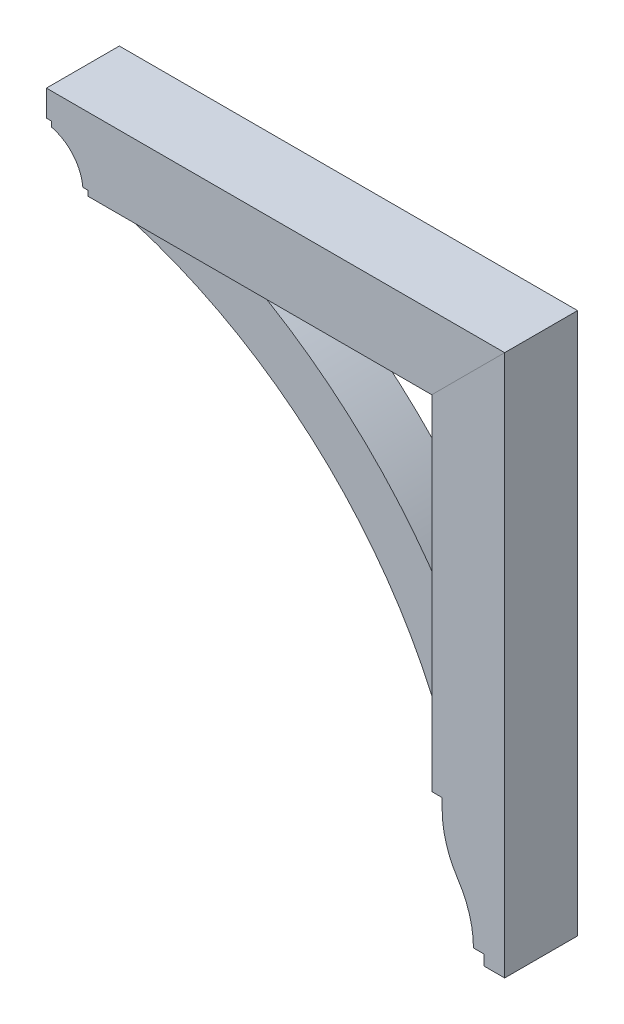
ISO-10303-21;
HEADER;
FILE_DESCRIPTION(('STEP AP214'),'2;1');
FILE_NAME('part.step','',(''),(''),'','','');
FILE_SCHEMA(('AUTOMOTIVE_DESIGN { 1 0 10303 214 1 1 1 1 }'));
ENDSEC;
DATA;
#1=APPLICATION_CONTEXT('core data for automotive mechanical design processes');
#2=APPLICATION_PROTOCOL_DEFINITION('international standard','automotive_design',2000,#1);
#3=PRODUCT_CONTEXT('',#1,'mechanical');
#4=PRODUCT('Part','Part','',(#3));
#5=PRODUCT_RELATED_PRODUCT_CATEGORY('part','',(#4));
#6=PRODUCT_DEFINITION_FORMATION('','',#4);
#7=PRODUCT_DEFINITION_CONTEXT('part definition',#1,'design');
#8=PRODUCT_DEFINITION('design','',#6,#7);
#9=PRODUCT_DEFINITION_SHAPE('','',#8);
#10=(LENGTH_UNIT() NAMED_UNIT(*) SI_UNIT(.MILLI.,.METRE.));
#11=(NAMED_UNIT(*) PLANE_ANGLE_UNIT() SI_UNIT($,.RADIAN.));
#12=(NAMED_UNIT(*) SI_UNIT($,.STERADIAN.) SOLID_ANGLE_UNIT());
#13=UNCERTAINTY_MEASURE_WITH_UNIT(LENGTH_MEASURE(1.E-05),#10,'distance_accuracy_value','');
#14=(GEOMETRIC_REPRESENTATION_CONTEXT(3) GLOBAL_UNCERTAINTY_ASSIGNED_CONTEXT((#13)) GLOBAL_UNIT_ASSIGNED_CONTEXT((#10,
#11,#12)) REPRESENTATION_CONTEXT('',''));
#15=CARTESIAN_POINT('',(0.,0.,0.));
#16=DIRECTION('',(0.,0.,1.));
#17=DIRECTION('',(1.,0.,0.));
#18=AXIS2_PLACEMENT_3D('',#15,#16,#17);
#19=CARTESIAN_POINT('',(246.881223015558,-2.15821431605898E-12,44.45));
#20=DIRECTION('',(1.,0.,0.));
#21=DIRECTION('',(0.,1.,0.));
#22=AXIS2_PLACEMENT_3D('',#19,#20,#21);
#23=PLANE('',#22);
#24=DIRECTION('',(0.,-1.,0.));
#25=VECTOR('',#24,1.);
#26=CARTESIAN_POINT('',(246.881223015558,-2.15821431605898E-12,-44.45));
#27=LINE('',#26,#25);
#28=CARTESIAN_POINT('',(246.881223015556,-183.515,-44.45));
#29=VERTEX_POINT('',#28);
#30=CARTESIAN_POINT('',(246.881223015556,-196.215,-44.45));
#31=VERTEX_POINT('',#30);
#32=EDGE_CURVE('E171',#29,#31,#27,.T.);
#33=ORIENTED_EDGE('',*,*,#32,.T.);
#34=DIRECTION('',(0.,0.,-1.));
#35=VECTOR('',#34,1.);
#36=CARTESIAN_POINT('',(246.881223015556,-196.215,44.45));
#37=LINE('',#36,#35);
#38=CARTESIAN_POINT('',(246.881223015556,-196.215,44.45));
#39=VERTEX_POINT('',#38);
#40=EDGE_CURVE('E12',#39,#31,#37,.T.);
#41=ORIENTED_EDGE('',*,*,#40,.F.);
#42=DIRECTION('',(0.,-1.,0.));
#43=VECTOR('',#42,1.);
#44=CARTESIAN_POINT('',(246.881223015558,-2.15821431605898E-12,44.45));
#45=LINE('',#44,#43);
#46=CARTESIAN_POINT('',(246.881223015556,-183.515,44.45));
#47=VERTEX_POINT('',#46);
#48=EDGE_CURVE('E203',#47,#39,#45,.T.);
#49=ORIENTED_EDGE('',*,*,#48,.F.);
#50=DIRECTION('',(0.,0.,-1.));
#51=VECTOR('',#50,1.);
#52=CARTESIAN_POINT('',(246.881223015556,-183.515,44.45));
#53=LINE('',#52,#51);
#54=EDGE_CURVE('E167',#47,#29,#53,.T.);
#55=ORIENTED_EDGE('',*,*,#54,.T.);
#56=EDGE_LOOP('',(#33,#41,#49,#55));
#57=FACE_BOUND('',#56,.T.);
#58=ADVANCED_FACE('F55',(#57),#23,.F.);
#59=CARTESIAN_POINT('',(362.768723015556,-196.215,44.45));
#60=DIRECTION('',(0.,0.,-1.));
#61=DIRECTION('',(-1.,0.,0.));
#62=AXIS2_PLACEMENT_3D('',#59,#60,#61);
#63=CYLINDRICAL_SURFACE('',#62,115.8875);
#64=CARTESIAN_POINT('',(362.768723015556,-196.215,-44.45));
#65=DIRECTION('',(0.,0.,1.));
#66=DIRECTION('',(1.,0.,0.));
#67=AXIS2_PLACEMENT_3D('',#64,#65,#66);
#68=CIRCLE('',#67,115.8875);
#69=CARTESIAN_POINT('',(266.018608336656,-260.006284403669,-44.45));
#70=VERTEX_POINT('',#69);
#71=EDGE_CURVE('E175',#31,#70,#68,.T.);
#72=ORIENTED_EDGE('',*,*,#71,.T.);
#73=DIRECTION('',(0.,0.,-1.));
#74=VECTOR('',#73,1.);
#75=CARTESIAN_POINT('',(266.018608336656,-260.006284403669,44.45));
#76=LINE('',#75,#74);
#77=CARTESIAN_POINT('',(266.018608336656,-260.006284403669,44.45));
#78=VERTEX_POINT('',#77);
#79=EDGE_CURVE('E64',#78,#70,#76,.T.);
#80=ORIENTED_EDGE('',*,*,#79,.F.);
#81=CARTESIAN_POINT('',(362.768723015556,-196.215,44.45));
#82=DIRECTION('',(0.,0.,1.));
#83=DIRECTION('',(1.,0.,0.));
#84=AXIS2_PLACEMENT_3D('',#81,#82,#83);
#85=CIRCLE('',#84,115.8875);
#86=EDGE_CURVE('E121',#39,#78,#85,.T.);
#87=ORIENTED_EDGE('',*,*,#86,.F.);
#88=ORIENTED_EDGE('',*,*,#40,.T.);
#89=EDGE_LOOP('',(#72,#80,#87,#88));
#90=FACE_BOUND('',#89,.T.);
#91=ADVANCED_FACE('F229',(#90),#63,.T.);
#92=CARTESIAN_POINT('',(170.152056348885,-323.215,44.45));
#93=DIRECTION('',(0.,0.,-1.));
#94=DIRECTION('',(-1.,0.,0.));
#95=AXIS2_PLACEMENT_3D('',#92,#93,#94);
#96=CYLINDRICAL_SURFACE('',#95,114.82916666667);
#97=CARTESIAN_POINT('',(170.152056348885,-323.215,-44.45));
#98=DIRECTION('',(0.,0.,1.));
#99=DIRECTION('',(1.,0.,0.));
#100=AXIS2_PLACEMENT_3D('',#97,#98,#99);
#101=CIRCLE('',#100,114.82916666667);
#102=CARTESIAN_POINT('',(284.981223015555,-323.215,-44.45));
#103=VERTEX_POINT('',#102);
#104=EDGE_CURVE('E178',#103,#70,#101,.T.);
#105=ORIENTED_EDGE('',*,*,#104,.F.);
#106=DIRECTION('',(0.,0.,-1.));
#107=VECTOR('',#106,1.);
#108=CARTESIAN_POINT('',(284.981223015555,-323.215,44.45));
#109=LINE('',#108,#107);
#110=CARTESIAN_POINT('',(284.981223015555,-323.215,44.45));
#111=VERTEX_POINT('',#110);
#112=EDGE_CURVE('E218',#111,#103,#109,.T.);
#113=ORIENTED_EDGE('',*,*,#112,.F.);
#114=CARTESIAN_POINT('',(170.152056348885,-323.215,44.45));
#115=DIRECTION('',(0.,0.,1.));
#116=DIRECTION('',(1.,0.,0.));
#117=AXIS2_PLACEMENT_3D('',#114,#115,#116);
#118=CIRCLE('',#117,114.82916666667);
#119=EDGE_CURVE('E228',#111,#78,#118,.T.);
#120=ORIENTED_EDGE('',*,*,#119,.T.);
#121=ORIENTED_EDGE('',*,*,#79,.T.);
#122=EDGE_LOOP('',(#105,#113,#120,#121));
#123=FACE_BOUND('',#122,.T.);
#124=ADVANCED_FACE('F226',(#123),#96,.F.);
#125=CARTESIAN_POINT('',(0.,-323.215,44.45));
#126=DIRECTION('',(0.,-1.,0.));
#127=DIRECTION('',(0.,0.,-1.));
#128=AXIS2_PLACEMENT_3D('',#125,#126,#127);
#129=PLANE('',#128);
#130=DIRECTION('',(-1.,0.,0.));
#131=VECTOR('',#130,1.);
#132=CARTESIAN_POINT('',(0.,-323.215,-44.45));
#133=LINE('',#132,#131);
#134=CARTESIAN_POINT('',(297.681223015555,-323.215,-44.45));
#135=VERTEX_POINT('',#134);
#136=EDGE_CURVE('E182',#135,#103,#133,.T.);
#137=ORIENTED_EDGE('',*,*,#136,.F.);
#138=DIRECTION('',(0.,0.,-1.));
#139=VECTOR('',#138,1.);
#140=CARTESIAN_POINT('',(297.681223015555,-323.215,44.45));
#141=LINE('',#140,#139);
#142=CARTESIAN_POINT('',(297.681223015555,-323.215,44.45));
#143=VERTEX_POINT('',#142);
#144=EDGE_CURVE('E215',#143,#135,#141,.T.);
#145=ORIENTED_EDGE('',*,*,#144,.F.);
#146=DIRECTION('',(-1.,0.,0.));
#147=VECTOR('',#146,1.);
#148=CARTESIAN_POINT('',(0.,-323.215,44.45));
#149=LINE('',#148,#147);
#150=EDGE_CURVE('E240',#143,#111,#149,.T.);
#151=ORIENTED_EDGE('',*,*,#150,.T.);
#152=ORIENTED_EDGE('',*,*,#112,.T.);
#153=EDGE_LOOP('',(#137,#145,#151,#152));
#154=FACE_BOUND('',#153,.T.);
#155=ADVANCED_FACE('F237',(#154),#129,.T.);
#156=CARTESIAN_POINT('',(297.681223015555,0.,44.45));
#157=DIRECTION('',(-1.,0.,0.));
#158=DIRECTION('',(0.,0.,1.));
#159=AXIS2_PLACEMENT_3D('',#156,#157,#158);
#160=PLANE('',#159);
#161=DIRECTION('',(0.,1.,0.));
#162=VECTOR('',#161,1.);
#163=CARTESIAN_POINT('',(297.681223015555,0.,-44.45));
#164=LINE('',#163,#162);
#165=CARTESIAN_POINT('',(297.681223015555,-335.915,-44.45));
#166=VERTEX_POINT('',#165);
#167=EDGE_CURVE('E186',#166,#135,#164,.T.);
#168=ORIENTED_EDGE('',*,*,#167,.F.);
#169=DIRECTION('',(0.,0.,-1.));
#170=VECTOR('',#169,1.);
#171=CARTESIAN_POINT('',(297.681223015555,-335.915,44.45));
#172=LINE('',#171,#170);
#173=CARTESIAN_POINT('',(297.681223015555,-335.915,44.45));
#174=VERTEX_POINT('',#173);
#175=EDGE_CURVE('E212',#174,#166,#172,.T.);
#176=ORIENTED_EDGE('',*,*,#175,.F.);
#177=DIRECTION('',(0.,1.,0.));
#178=VECTOR('',#177,1.);
#179=CARTESIAN_POINT('',(297.681223015555,0.,44.45));
#180=LINE('',#179,#178);
#181=EDGE_CURVE('E246',#174,#143,#180,.T.);
#182=ORIENTED_EDGE('',*,*,#181,.T.);
#183=ORIENTED_EDGE('',*,*,#144,.T.);
#184=EDGE_LOOP('',(#168,#176,#182,#183));
#185=FACE_BOUND('',#184,.T.);
#186=ADVANCED_FACE('F261',(#185),#160,.T.);
#187=CARTESIAN_POINT('',(7.34134975033387E-13,-335.915000000001,44.45));
#188=DIRECTION('',(0.,-1.,0.));
#189=DIRECTION('',(1.,0.,0.));
#190=AXIS2_PLACEMENT_3D('',#187,#188,#189);
#191=PLANE('',#190);
#192=DIRECTION('',(-1.,0.,0.));
#193=VECTOR('',#192,1.);
#194=CARTESIAN_POINT('',(7.34134975033387E-13,-335.915000000001,-44.45));
#195=LINE('',#194,#193);
#196=CARTESIAN_POINT('',(323.081223015555,-335.915,-44.45));
#197=VERTEX_POINT('',#196);
#198=EDGE_CURVE('E190',#197,#166,#195,.T.);
#199=ORIENTED_EDGE('',*,*,#198,.F.);
#200=DIRECTION('',(0.,0.,-1.));
#201=VECTOR('',#200,1.);
#202=CARTESIAN_POINT('',(323.081223015555,-335.915,44.45));
#203=LINE('',#202,#201);
#204=CARTESIAN_POINT('',(323.081223015555,-335.915,44.45));
#205=VERTEX_POINT('',#204);
#206=EDGE_CURVE('E209',#205,#197,#203,.T.);
#207=ORIENTED_EDGE('',*,*,#206,.F.);
#208=DIRECTION('',(-1.,0.,0.));
#209=VECTOR('',#208,1.);
#210=CARTESIAN_POINT('',(7.34134975033387E-13,-335.915000000001,44.45));
#211=LINE('',#210,#209);
#212=EDGE_CURVE('E254',#205,#174,#211,.T.);
#213=ORIENTED_EDGE('',*,*,#212,.T.);
#214=ORIENTED_EDGE('',*,*,#175,.T.);
#215=EDGE_LOOP('',(#199,#207,#213,#214));
#216=FACE_BOUND('',#215,.T.);
#217=ADVANCED_FACE('F259',(#216),#191,.T.);
#218=CARTESIAN_POINT('',(323.081223015555,0.,44.45));
#219=DIRECTION('',(-1.,0.,0.));
#220=DIRECTION('',(0.,0.,1.));
#221=AXIS2_PLACEMENT_3D('',#218,#219,#220);
#222=PLANE('',#221);
#223=DIRECTION('',(0.,1.,0.));
#224=VECTOR('',#223,1.);
#225=CARTESIAN_POINT('',(323.081223015555,0.,-44.45));
#226=LINE('',#225,#224);
#227=CARTESIAN_POINT('',(323.081223015555,324.485,-44.45));
#228=VERTEX_POINT('',#227);
#229=EDGE_CURVE('E194',#197,#228,#226,.T.);
#230=ORIENTED_EDGE('',*,*,#229,.T.);
#231=DIRECTION('',(0.,0.,-1.));
#232=VECTOR('',#231,1.);
#233=CARTESIAN_POINT('',(323.081223015555,324.485,44.45));
#234=LINE('',#233,#232);
#235=CARTESIAN_POINT('',(323.081223015555,324.485,44.45));
#236=VERTEX_POINT('',#235);
#237=EDGE_CURVE('E158',#236,#228,#234,.T.);
#238=ORIENTED_EDGE('',*,*,#237,.F.);
#239=DIRECTION('',(0.,1.,0.));
#240=VECTOR('',#239,1.);
#241=CARTESIAN_POINT('',(323.081223015555,0.,44.45));
#242=LINE('',#241,#240);
#243=EDGE_CURVE('E147',#205,#236,#242,.T.);
#244=ORIENTED_EDGE('',*,*,#243,.F.);
#245=ORIENTED_EDGE('',*,*,#206,.T.);
#246=EDGE_LOOP('',(#230,#238,#244,#245));
#247=FACE_BOUND('',#246,.T.);
#248=ADVANCED_FACE('F264',(#247),#222,.F.);
#249=CARTESIAN_POINT('',(-0.701888492220435,0.701888492220426,44.45));
#250=DIRECTION('',(0.707106781186552,-0.707106781186543,0.));
#251=DIRECTION('',(0.707106781186543,0.707106781186552,0.));
#252=AXIS2_PLACEMENT_3D('',#249,#250,#251);
#253=PLANE('',#252);
#254=DIRECTION('',(-0.707106781186543,-0.707106781186552,0.));
#255=VECTOR('',#254,1.);
#256=CARTESIAN_POINT('',(-0.701888492220435,0.701888492220426,-44.45));
#257=LINE('',#256,#255);
#258=CARTESIAN_POINT('',(234.181223015556,235.585,-44.45));
#259=VERTEX_POINT('',#258);
#260=EDGE_CURVE('E156',#228,#259,#257,.T.);
#261=ORIENTED_EDGE('',*,*,#260,.T.);
#262=DIRECTION('',(0.,0.,-1.));
#263=VECTOR('',#262,1.);
#264=CARTESIAN_POINT('',(234.181223015556,235.585,44.45));
#265=LINE('',#264,#263);
#266=CARTESIAN_POINT('',(234.181223015556,235.585,44.45));
#267=VERTEX_POINT('',#266);
#268=EDGE_CURVE('E153',#267,#259,#265,.T.);
#269=ORIENTED_EDGE('',*,*,#268,.F.);
#270=DIRECTION('',(-0.707106781186543,-0.707106781186552,0.));
#271=VECTOR('',#270,1.);
#272=CARTESIAN_POINT('',(-0.701888492220435,0.701888492220426,44.45));
#273=LINE('',#272,#271);
#274=EDGE_CURVE('E140',#236,#267,#273,.T.);
#275=ORIENTED_EDGE('',*,*,#274,.F.);
#276=ORIENTED_EDGE('',*,*,#237,.T.);
#277=EDGE_LOOP('',(#261,#269,#275,#276));
#278=FACE_BOUND('',#277,.T.);
#279=ADVANCED_FACE('F154',(#278),#253,.F.);
#280=CARTESIAN_POINT('',(234.181223015556,0.,44.45));
#281=DIRECTION('',(1.,0.,0.));
#282=DIRECTION('',(0.,1.,0.));
#283=AXIS2_PLACEMENT_3D('',#280,#281,#282);
#284=PLANE('',#283);
#285=DIRECTION('',(0.,-1.,0.));
#286=VECTOR('',#285,1.);
#287=CARTESIAN_POINT('',(234.181223015556,0.,-44.45));
#288=LINE('',#287,#286);
#289=CARTESIAN_POINT('',(234.181223015556,-183.515,-44.45));
#290=VERTEX_POINT('',#289);
#291=EDGE_CURVE('E107',#259,#290,#288,.T.);
#292=ORIENTED_EDGE('',*,*,#291,.T.);
#293=DIRECTION('',(0.,0.,-1.));
#294=VECTOR('',#293,1.);
#295=CARTESIAN_POINT('',(234.181223015556,-183.515,44.45));
#296=LINE('',#295,#294);
#297=CARTESIAN_POINT('',(234.181223015556,-183.515,44.45));
#298=VERTEX_POINT('',#297);
#299=EDGE_CURVE('E159',#298,#290,#296,.T.);
#300=ORIENTED_EDGE('',*,*,#299,.F.);
#301=DIRECTION('',(0.,-1.,0.));
#302=VECTOR('',#301,1.);
#303=CARTESIAN_POINT('',(234.181223015556,0.,44.45));
#304=LINE('',#303,#302);
#305=EDGE_CURVE('E144',#267,#298,#304,.T.);
#306=ORIENTED_EDGE('',*,*,#305,.F.);
#307=ORIENTED_EDGE('',*,*,#268,.T.);
#308=EDGE_LOOP('',(#292,#300,#306,#307));
#309=FACE_BOUND('',#308,.T.);
#310=ADVANCED_FACE('F161',(#309),#284,.F.);
#311=CARTESIAN_POINT('',(0.,-183.515,44.45));
#312=DIRECTION('',(0.,1.,0.));
#313=DIRECTION('',(0.,0.,1.));
#314=AXIS2_PLACEMENT_3D('',#311,#312,#313);
#315=PLANE('',#314);
#316=DIRECTION('',(1.,0.,0.));
#317=VECTOR('',#316,1.);
#318=CARTESIAN_POINT('',(0.,-183.515,-44.45));
#319=LINE('',#318,#317);
#320=EDGE_CURVE('E113',#290,#29,#319,.T.);
#321=ORIENTED_EDGE('',*,*,#320,.T.);
#322=ORIENTED_EDGE('',*,*,#54,.F.);
#323=DIRECTION('',(1.,0.,0.));
#324=VECTOR('',#323,1.);
#325=CARTESIAN_POINT('',(0.,-183.515,44.45));
#326=LINE('',#325,#324);
#327=EDGE_CURVE('E72',#298,#47,#326,.T.);
#328=ORIENTED_EDGE('',*,*,#327,.F.);
#329=ORIENTED_EDGE('',*,*,#299,.T.);
#330=EDGE_LOOP('',(#321,#322,#328,#329));
#331=FACE_BOUND('',#330,.T.);
#332=ADVANCED_FACE('F279',(#331),#315,.F.);
#333=CARTESIAN_POINT('',(0.,0.,44.45));
#334=DIRECTION('',(0.,0.,1.));
#335=DIRECTION('',(1.,0.,0.));
#336=AXIS2_PLACEMENT_3D('',#333,#334,#335);
#337=PLANE('',#336);
#338=ORIENTED_EDGE('',*,*,#48,.T.);
#339=ORIENTED_EDGE('',*,*,#86,.T.);
#340=ORIENTED_EDGE('',*,*,#119,.F.);
#341=ORIENTED_EDGE('',*,*,#150,.F.);
#342=ORIENTED_EDGE('',*,*,#181,.F.);
#343=ORIENTED_EDGE('',*,*,#212,.F.);
#344=ORIENTED_EDGE('',*,*,#243,.T.);
#345=ORIENTED_EDGE('',*,*,#274,.T.);
#346=ORIENTED_EDGE('',*,*,#305,.T.);
#347=ORIENTED_EDGE('',*,*,#327,.T.);
#348=EDGE_LOOP('',(#338,#339,#340,#341,#342,#343,#344,#345,#346,#347));
#349=FACE_BOUND('',#348,.T.);
#350=ADVANCED_FACE('F142',(#349),#337,.T.);
#351=CARTESIAN_POINT('',(0.,0.,-44.45));
#352=DIRECTION('',(0.,0.,1.));
#353=DIRECTION('',(1.,0.,0.));
#354=AXIS2_PLACEMENT_3D('',#351,#352,#353);
#355=PLANE('',#354);
#356=ORIENTED_EDGE('',*,*,#32,.F.);
#357=ORIENTED_EDGE('',*,*,#320,.F.);
#358=ORIENTED_EDGE('',*,*,#291,.F.);
#359=ORIENTED_EDGE('',*,*,#260,.F.);
#360=ORIENTED_EDGE('',*,*,#229,.F.);
#361=ORIENTED_EDGE('',*,*,#198,.T.);
#362=ORIENTED_EDGE('',*,*,#167,.T.);
#363=ORIENTED_EDGE('',*,*,#136,.T.);
#364=ORIENTED_EDGE('',*,*,#104,.T.);
#365=ORIENTED_EDGE('',*,*,#71,.F.);
#366=EDGE_LOOP('',(#356,#357,#358,#359,#360,#361,#362,#363,#364,#365));
#367=FACE_BOUND('',#366,.T.);
#368=ADVANCED_FACE('F233',(#367),#355,.F.);
#369=CLOSED_SHELL('',(#58,#91,#124,#155,#186,#217,#248,#279,#310,#332,#350,#368));
#370=MANIFOLD_SOLID_BREP('B2',#369);
#371=CARTESIAN_POINT('',(-306.558557439418,-332.634542246651,31.75));
#372=DIRECTION('',(0.,0.,-1.));
#373=DIRECTION('',(-1.,0.,0.));
#374=AXIS2_PLACEMENT_3D('',#371,#372,#373);
#375=CYLINDRICAL_SURFACE('',#374,644.525);
#376=CARTESIAN_POINT('',(-306.558557439418,-332.634542246651,-31.75));
#377=DIRECTION('',(0.,0.,1.));
#378=DIRECTION('',(1.,0.,0.));
#379=AXIS2_PLACEMENT_3D('',#376,#377,#378);
#380=CIRCLE('',#379,644.525);
#381=CARTESIAN_POINT('',(-2.35627698444407,235.585,-31.75));
#382=VERTEX_POINT('',#381);
#383=CARTESIAN_POINT('',(234.181223015556,18.0974999999995,-31.75));
#384=VERTEX_POINT('',#383);
#385=EDGE_CURVE('E474',#382,#384,#380,.F.);
#386=ORIENTED_EDGE('',*,*,#385,.F.);
#387=DIRECTION('',(0.,0.,-1.));
#388=VECTOR('',#387,1.);
#389=CARTESIAN_POINT('',(-2.35627698444407,235.585,31.75));
#390=LINE('',#389,#388);
#391=CARTESIAN_POINT('',(-2.35627698444407,235.585,31.75));
#392=VERTEX_POINT('',#391);
#393=EDGE_CURVE('E53',#392,#382,#390,.T.);
#394=ORIENTED_EDGE('',*,*,#393,.F.);
#395=CARTESIAN_POINT('',(-306.558557439418,-332.634542246651,31.75));
#396=DIRECTION('',(0.,0.,1.));
#397=DIRECTION('',(1.,0.,0.));
#398=AXIS2_PLACEMENT_3D('',#395,#396,#397);
#399=CIRCLE('',#398,644.525);
#400=CARTESIAN_POINT('',(234.181223015556,18.0974999999995,31.75));
#401=VERTEX_POINT('',#400);
#402=EDGE_CURVE('E492',#392,#401,#399,.F.);
#403=ORIENTED_EDGE('',*,*,#402,.T.);
#404=DIRECTION('',(0.,0.,-1.));
#405=VECTOR('',#404,1.);
#406=CARTESIAN_POINT('',(234.181223015556,18.0974999999995,31.75));
#407=LINE('',#406,#405);
#408=EDGE_CURVE('E402',#401,#384,#407,.T.);
#409=ORIENTED_EDGE('',*,*,#408,.T.);
#410=EDGE_LOOP('',(#386,#394,#403,#409));
#411=FACE_BOUND('',#410,.T.);
#412=ADVANCED_FACE('F385',(#411),#375,.T.);
#413=CARTESIAN_POINT('',(0.,235.585,31.75));
#414=DIRECTION('',(0.,1.,0.));
#415=DIRECTION('',(0.,0.,1.));
#416=AXIS2_PLACEMENT_3D('',#413,#414,#415);
#417=PLANE('',#416);
#418=DIRECTION('',(1.,0.,0.));
#419=VECTOR('',#418,1.);
#420=CARTESIAN_POINT('',(0.,235.585,-31.75));
#421=LINE('',#420,#419);
#422=CARTESIAN_POINT('',(-140.468776984445,235.585,-31.75));
#423=VERTEX_POINT('',#422);
#424=EDGE_CURVE('E477',#423,#382,#421,.T.);
#425=ORIENTED_EDGE('',*,*,#424,.F.);
#426=DIRECTION('',(0.,0.,-1.));
#427=VECTOR('',#426,1.);
#428=CARTESIAN_POINT('',(-140.468776984445,235.585,31.75));
#429=LINE('',#428,#427);
#430=CARTESIAN_POINT('',(-140.468776984445,235.585,31.75));
#431=VERTEX_POINT('',#430);
#432=EDGE_CURVE('E394',#431,#423,#429,.T.);
#433=ORIENTED_EDGE('',*,*,#432,.F.);
#434=DIRECTION('',(1.,0.,0.));
#435=VECTOR('',#434,1.);
#436=CARTESIAN_POINT('',(0.,235.585,31.75));
#437=LINE('',#436,#435);
#438=EDGE_CURVE('E508',#431,#392,#437,.T.);
#439=ORIENTED_EDGE('',*,*,#438,.T.);
#440=ORIENTED_EDGE('',*,*,#393,.T.);
#441=EDGE_LOOP('',(#425,#433,#439,#440));
#442=FACE_BOUND('',#441,.T.);
#443=ADVANCED_FACE('F507',(#442),#417,.T.);
#444=CARTESIAN_POINT('',(-140.468776984445,0.,31.75));
#445=DIRECTION('',(1.,0.,0.));
#446=DIRECTION('',(0.,0.,-1.));
#447=AXIS2_PLACEMENT_3D('',#444,#445,#446);
#448=PLANE('',#447);
#449=DIRECTION('',(0.,-1.,0.));
#450=VECTOR('',#449,1.);
#451=CARTESIAN_POINT('',(-140.468776984445,0.,-31.75));
#452=LINE('',#451,#450);
#453=CARTESIAN_POINT('',(-140.468776984445,222.885,-31.75));
#454=VERTEX_POINT('',#453);
#455=EDGE_CURVE('E481',#423,#454,#452,.T.);
#456=ORIENTED_EDGE('',*,*,#455,.T.);
#457=DIRECTION('',(0.,0.,-1.));
#458=VECTOR('',#457,1.);
#459=CARTESIAN_POINT('',(-140.468776984445,222.885,31.75));
#460=LINE('',#459,#458);
#461=CARTESIAN_POINT('',(-140.468776984445,222.885,31.75));
#462=VERTEX_POINT('',#461);
#463=EDGE_CURVE('E462',#462,#454,#460,.T.);
#464=ORIENTED_EDGE('',*,*,#463,.F.);
#465=DIRECTION('',(0.,-1.,0.));
#466=VECTOR('',#465,1.);
#467=CARTESIAN_POINT('',(-140.468776984445,0.,31.75));
#468=LINE('',#467,#466);
#469=EDGE_CURVE('E448',#431,#462,#468,.T.);
#470=ORIENTED_EDGE('',*,*,#469,.F.);
#471=ORIENTED_EDGE('',*,*,#432,.T.);
#472=EDGE_LOOP('',(#456,#464,#470,#471));
#473=FACE_BOUND('',#472,.T.);
#474=ADVANCED_FACE('F501',(#473),#448,.F.);
#475=CARTESIAN_POINT('',(-307.058361997729,-332.088626915146,31.75));
#476=DIRECTION('',(0.,0.,-1.));
#477=DIRECTION('',(-1.,0.,0.));
#478=AXIS2_PLACEMENT_3D('',#475,#476,#477);
#479=CYLINDRICAL_SURFACE('',#478,579.4375);
#480=CARTESIAN_POINT('',(-307.058361997729,-332.088626915146,-31.75));
#481=DIRECTION('',(0.,0.,1.));
#482=DIRECTION('',(1.,0.,0.));
#483=AXIS2_PLACEMENT_3D('',#480,#481,#482);
#484=CIRCLE('',#483,579.4375);
#485=CARTESIAN_POINT('',(221.481223015556,-94.6150000000001,-31.75));
#486=VERTEX_POINT('',#485);
#487=EDGE_CURVE('E458',#454,#486,#484,.F.);
#488=ORIENTED_EDGE('',*,*,#487,.T.);
#489=DIRECTION('',(0.,0.,-1.));
#490=VECTOR('',#489,1.);
#491=CARTESIAN_POINT('',(221.481223015556,-94.6150000000001,31.75));
#492=LINE('',#491,#490);
#493=CARTESIAN_POINT('',(221.481223015556,-94.6150000000001,31.75));
#494=VERTEX_POINT('',#493);
#495=EDGE_CURVE('E455',#494,#486,#492,.T.);
#496=ORIENTED_EDGE('',*,*,#495,.F.);
#497=CARTESIAN_POINT('',(-307.058361997729,-332.088626915146,31.75));
#498=DIRECTION('',(0.,0.,1.));
#499=DIRECTION('',(1.,0.,0.));
#500=AXIS2_PLACEMENT_3D('',#497,#498,#499);
#501=CIRCLE('',#500,579.4375);
#502=EDGE_CURVE('E440',#462,#494,#501,.F.);
#503=ORIENTED_EDGE('',*,*,#502,.F.);
#504=ORIENTED_EDGE('',*,*,#463,.T.);
#505=EDGE_LOOP('',(#488,#496,#503,#504));
#506=FACE_BOUND('',#505,.T.);
#507=ADVANCED_FACE('F456',(#506),#479,.F.);
#508=CARTESIAN_POINT('',(0.,-94.6150000000001,31.75));
#509=DIRECTION('',(0.,-1.,0.));
#510=DIRECTION('',(0.,0.,-1.));
#511=AXIS2_PLACEMENT_3D('',#508,#509,#510);
#512=PLANE('',#511);
#513=DIRECTION('',(-1.,0.,0.));
#514=VECTOR('',#513,1.);
#515=CARTESIAN_POINT('',(0.,-94.6150000000001,-31.75));
#516=LINE('',#515,#514);
#517=CARTESIAN_POINT('',(234.181223015556,-94.6150000000001,-31.75));
#518=VERTEX_POINT('',#517);
#519=EDGE_CURVE('E486',#518,#486,#516,.T.);
#520=ORIENTED_EDGE('',*,*,#519,.F.);
#521=DIRECTION('',(0.,0.,-1.));
#522=VECTOR('',#521,1.);
#523=CARTESIAN_POINT('',(234.181223015556,-94.6150000000001,31.75));
#524=LINE('',#523,#522);
#525=CARTESIAN_POINT('',(234.181223015556,-94.6150000000001,31.75));
#526=VERTEX_POINT('',#525);
#527=EDGE_CURVE('E421',#526,#518,#524,.T.);
#528=ORIENTED_EDGE('',*,*,#527,.F.);
#529=DIRECTION('',(-1.,0.,0.));
#530=VECTOR('',#529,1.);
#531=CARTESIAN_POINT('',(0.,-94.6150000000001,31.75));
#532=LINE('',#531,#530);
#533=EDGE_CURVE('E445',#526,#494,#532,.T.);
#534=ORIENTED_EDGE('',*,*,#533,.T.);
#535=ORIENTED_EDGE('',*,*,#495,.T.);
#536=EDGE_LOOP('',(#520,#528,#534,#535));
#537=FACE_BOUND('',#536,.T.);
#538=ADVANCED_FACE('F464',(#537),#512,.T.);
#539=CARTESIAN_POINT('',(234.181223015556,0.,31.75));
#540=DIRECTION('',(1.,0.,0.));
#541=DIRECTION('',(0.,1.,0.));
#542=AXIS2_PLACEMENT_3D('',#539,#540,#541);
#543=PLANE('',#542);
#544=DIRECTION('',(0.,-1.,0.));
#545=VECTOR('',#544,1.);
#546=CARTESIAN_POINT('',(234.181223015556,0.,-31.75));
#547=LINE('',#546,#545);
#548=EDGE_CURVE('E489',#384,#518,#547,.T.);
#549=ORIENTED_EDGE('',*,*,#548,.F.);
#550=ORIENTED_EDGE('',*,*,#408,.F.);
#551=DIRECTION('',(0.,-1.,0.));
#552=VECTOR('',#551,1.);
#553=CARTESIAN_POINT('',(234.181223015556,0.,31.75));
#554=LINE('',#553,#552);
#555=EDGE_CURVE('E466',#401,#526,#554,.T.);
#556=ORIENTED_EDGE('',*,*,#555,.T.);
#557=ORIENTED_EDGE('',*,*,#527,.T.);
#558=EDGE_LOOP('',(#549,#550,#556,#557));
#559=FACE_BOUND('',#558,.T.);
#560=ADVANCED_FACE('F509',(#559),#543,.T.);
#561=CARTESIAN_POINT('',(0.,0.,31.75));
#562=DIRECTION('',(0.,0.,1.));
#563=DIRECTION('',(1.,0.,0.));
#564=AXIS2_PLACEMENT_3D('',#561,#562,#563);
#565=PLANE('',#564);
#566=ORIENTED_EDGE('',*,*,#402,.F.);
#567=ORIENTED_EDGE('',*,*,#438,.F.);
#568=ORIENTED_EDGE('',*,*,#469,.T.);
#569=ORIENTED_EDGE('',*,*,#502,.T.);
#570=ORIENTED_EDGE('',*,*,#533,.F.);
#571=ORIENTED_EDGE('',*,*,#555,.F.);
#572=EDGE_LOOP('',(#566,#567,#568,#569,#570,#571));
#573=FACE_BOUND('',#572,.T.);
#574=ADVANCED_FACE('F442',(#573),#565,.T.);
#575=CARTESIAN_POINT('',(0.,0.,-31.75));
#576=DIRECTION('',(0.,0.,1.));
#577=DIRECTION('',(1.,0.,0.));
#578=AXIS2_PLACEMENT_3D('',#575,#576,#577);
#579=PLANE('',#578);
#580=ORIENTED_EDGE('',*,*,#385,.T.);
#581=ORIENTED_EDGE('',*,*,#548,.T.);
#582=ORIENTED_EDGE('',*,*,#519,.T.);
#583=ORIENTED_EDGE('',*,*,#487,.F.);
#584=ORIENTED_EDGE('',*,*,#455,.F.);
#585=ORIENTED_EDGE('',*,*,#424,.T.);
#586=EDGE_LOOP('',(#580,#581,#582,#583,#584,#585));
#587=FACE_BOUND('',#586,.T.);
#588=ADVANCED_FACE('F506',(#587),#579,.F.);
#589=CLOSED_SHELL('',(#412,#443,#474,#507,#538,#560,#574,#588));
#590=MANIFOLD_SOLID_BREP('B6',#589);
#591=CARTESIAN_POINT('',(-229.368776984446,1.00256101314268E-12,44.45));
#592=DIRECTION('',(-1.,0.,0.));
#593=DIRECTION('',(0.,-1.,0.));
#594=AXIS2_PLACEMENT_3D('',#591,#592,#593);
#595=PLANE('',#594);
#596=DIRECTION('',(0.,1.,0.));
#597=VECTOR('',#596,1.);
#598=CARTESIAN_POINT('',(-229.368776984446,1.00256101314268E-12,-44.45));
#599=LINE('',#598,#597);
#600=CARTESIAN_POINT('',(-229.368776984445,286.385,-44.45));
#601=VERTEX_POINT('',#600);
#602=CARTESIAN_POINT('',(-229.368776984445,292.735,-44.45));
#603=VERTEX_POINT('',#602);
#604=EDGE_CURVE('E692',#601,#603,#599,.T.);
#605=ORIENTED_EDGE('',*,*,#604,.F.);
#606=DIRECTION('',(0.,0.,-1.));
#607=VECTOR('',#606,1.);
#608=CARTESIAN_POINT('',(-229.368776984445,286.385,44.45));
#609=LINE('',#608,#607);
#610=CARTESIAN_POINT('',(-229.368776984445,286.385,44.45));
#611=VERTEX_POINT('',#610);
#612=EDGE_CURVE('E383',#611,#601,#609,.T.);
#613=ORIENTED_EDGE('',*,*,#612,.F.);
#614=DIRECTION('',(0.,1.,0.));
#615=VECTOR('',#614,1.);
#616=CARTESIAN_POINT('',(-229.368776984446,1.00256101314268E-12,44.45));
#617=LINE('',#616,#615);
#618=CARTESIAN_POINT('',(-229.368776984445,292.735,44.45));
#619=VERTEX_POINT('',#618);
#620=EDGE_CURVE('E723',#611,#619,#617,.T.);
#621=ORIENTED_EDGE('',*,*,#620,.T.);
#622=DIRECTION('',(0.,0.,-1.));
#623=VECTOR('',#622,1.);
#624=CARTESIAN_POINT('',(-229.368776984445,292.735,44.45));
#625=LINE('',#624,#623);
#626=EDGE_CURVE('E603',#619,#603,#625,.T.);
#627=ORIENTED_EDGE('',*,*,#626,.T.);
#628=EDGE_LOOP('',(#605,#613,#621,#627));
#629=FACE_BOUND('',#628,.T.);
#630=ADVANCED_FACE('F586',(#629),#595,.T.);
#631=CARTESIAN_POINT('',(-241.780101736884,237.193150212195,44.45));
#632=DIRECTION('',(0.,0.,-1.));
#633=DIRECTION('',(-1.,0.,0.));
#634=AXIS2_PLACEMENT_3D('',#631,#632,#633);
#635=CYLINDRICAL_SURFACE('',#634,50.7334117486339);
#636=CARTESIAN_POINT('',(-241.780101736884,237.193150212195,-44.45));
#637=DIRECTION('',(0.,0.,1.));
#638=DIRECTION('',(1.,0.,0.));
#639=AXIS2_PLACEMENT_3D('',#636,#637,#638);
#640=CIRCLE('',#639,50.7334117486339);
#641=CARTESIAN_POINT('',(-191.268776984445,241.935,-44.45));
#642=VERTEX_POINT('',#641);
#643=EDGE_CURVE('E695',#601,#642,#640,.F.);
#644=ORIENTED_EDGE('',*,*,#643,.T.);
#645=DIRECTION('',(0.,0.,-1.));
#646=VECTOR('',#645,1.);
#647=CARTESIAN_POINT('',(-191.268776984445,241.935,44.45));
#648=LINE('',#647,#646);
#649=CARTESIAN_POINT('',(-191.268776984445,241.935,44.45));
#650=VERTEX_POINT('',#649);
#651=EDGE_CURVE('E595',#650,#642,#648,.T.);
#652=ORIENTED_EDGE('',*,*,#651,.F.);
#653=CARTESIAN_POINT('',(-241.780101736884,237.193150212195,44.45));
#654=DIRECTION('',(0.,0.,1.));
#655=DIRECTION('',(1.,0.,0.));
#656=AXIS2_PLACEMENT_3D('',#653,#654,#655);
#657=CIRCLE('',#656,50.7334117486339);
#658=EDGE_CURVE('E759',#611,#650,#657,.F.);
#659=ORIENTED_EDGE('',*,*,#658,.F.);
#660=ORIENTED_EDGE('',*,*,#612,.T.);
#661=EDGE_LOOP('',(#644,#652,#659,#660));
#662=FACE_BOUND('',#661,.T.);
#663=ADVANCED_FACE('F748',(#662),#635,.F.);
#664=CARTESIAN_POINT('',(0.,241.935,44.45));
#665=DIRECTION('',(0.,-1.,0.));
#666=DIRECTION('',(0.,0.,-1.));
#667=AXIS2_PLACEMENT_3D('',#664,#665,#666);
#668=PLANE('',#667);
#669=DIRECTION('',(-1.,0.,0.));
#670=VECTOR('',#669,1.);
#671=CARTESIAN_POINT('',(0.,241.935,-44.45));
#672=LINE('',#671,#670);
#673=CARTESIAN_POINT('',(-184.918776984445,241.935,-44.45));
#674=VERTEX_POINT('',#673);
#675=EDGE_CURVE('E699',#674,#642,#672,.T.);
#676=ORIENTED_EDGE('',*,*,#675,.F.);
#677=DIRECTION('',(0.,0.,-1.));
#678=VECTOR('',#677,1.);
#679=CARTESIAN_POINT('',(-184.918776984445,241.935,44.45));
#680=LINE('',#679,#678);
#681=CARTESIAN_POINT('',(-184.918776984445,241.935,44.45));
#682=VERTEX_POINT('',#681);
#683=EDGE_CURVE('E736',#682,#674,#680,.T.);
#684=ORIENTED_EDGE('',*,*,#683,.F.);
#685=DIRECTION('',(-1.,0.,0.));
#686=VECTOR('',#685,1.);
#687=CARTESIAN_POINT('',(0.,241.935,44.45));
#688=LINE('',#687,#686);
#689=EDGE_CURVE('E745',#682,#650,#688,.T.);
#690=ORIENTED_EDGE('',*,*,#689,.T.);
#691=ORIENTED_EDGE('',*,*,#651,.T.);
#692=EDGE_LOOP('',(#676,#684,#690,#691));
#693=FACE_BOUND('',#692,.T.);
#694=ADVANCED_FACE('F743',(#693),#668,.T.);
#695=CARTESIAN_POINT('',(-184.918776984445,0.,44.45));
#696=DIRECTION('',(-1.,0.,0.));
#697=DIRECTION('',(0.,0.,1.));
#698=AXIS2_PLACEMENT_3D('',#695,#696,#697);
#699=PLANE('',#698);
#700=DIRECTION('',(0.,1.,0.));
#701=VECTOR('',#700,1.);
#702=CARTESIAN_POINT('',(-184.918776984445,0.,-44.45));
#703=LINE('',#702,#701);
#704=CARTESIAN_POINT('',(-184.918776984445,235.585,-44.45));
#705=VERTEX_POINT('',#704);
#706=EDGE_CURVE('E703',#705,#674,#703,.T.);
#707=ORIENTED_EDGE('',*,*,#706,.F.);
#708=DIRECTION('',(0.,0.,-1.));
#709=VECTOR('',#708,1.);
#710=CARTESIAN_POINT('',(-184.918776984445,235.585,44.45));
#711=LINE('',#710,#709);
#712=CARTESIAN_POINT('',(-184.918776984445,235.585,44.45));
#713=VERTEX_POINT('',#712);
#714=EDGE_CURVE('E733',#713,#705,#711,.T.);
#715=ORIENTED_EDGE('',*,*,#714,.F.);
#716=DIRECTION('',(0.,1.,0.));
#717=VECTOR('',#716,1.);
#718=CARTESIAN_POINT('',(-184.918776984445,0.,44.45));
#719=LINE('',#718,#717);
#720=EDGE_CURVE('E758',#713,#682,#719,.T.);
#721=ORIENTED_EDGE('',*,*,#720,.T.);
#722=ORIENTED_EDGE('',*,*,#683,.T.);
#723=EDGE_LOOP('',(#707,#715,#721,#722));
#724=FACE_BOUND('',#723,.T.);
#725=ADVANCED_FACE('F754',(#724),#699,.T.);
#726=CARTESIAN_POINT('',(0.,235.585,44.45));
#727=DIRECTION('',(0.,1.,0.));
#728=DIRECTION('',(0.,0.,1.));
#729=AXIS2_PLACEMENT_3D('',#726,#727,#728);
#730=PLANE('',#729);
#731=DIRECTION('',(1.,0.,0.));
#732=VECTOR('',#731,1.);
#733=CARTESIAN_POINT('',(0.,235.585,-44.45));
#734=LINE('',#733,#732);
#735=CARTESIAN_POINT('',(234.181223015556,235.585,-44.45));
#736=VERTEX_POINT('',#735);
#737=EDGE_CURVE('E707',#705,#736,#734,.T.);
#738=ORIENTED_EDGE('',*,*,#737,.T.);
#739=DIRECTION('',(0.,0.,-1.));
#740=VECTOR('',#739,1.);
#741=CARTESIAN_POINT('',(234.181223015556,235.585,44.45));
#742=LINE('',#741,#740);
#743=CARTESIAN_POINT('',(234.181223015556,235.585,44.45));
#744=VERTEX_POINT('',#743);
#745=EDGE_CURVE('E730',#744,#736,#742,.T.);
#746=ORIENTED_EDGE('',*,*,#745,.F.);
#747=DIRECTION('',(1.,0.,0.));
#748=VECTOR('',#747,1.);
#749=CARTESIAN_POINT('',(0.,235.585,44.45));
#750=LINE('',#749,#748);
#751=EDGE_CURVE('E763',#713,#744,#750,.T.);
#752=ORIENTED_EDGE('',*,*,#751,.F.);
#753=ORIENTED_EDGE('',*,*,#714,.T.);
#754=EDGE_LOOP('',(#738,#746,#752,#753));
#755=FACE_BOUND('',#754,.T.);
#756=ADVANCED_FACE('F795',(#755),#730,.F.);
#757=CARTESIAN_POINT('',(-0.701888492220435,0.701888492220426,44.45));
#758=DIRECTION('',(0.707106781186552,-0.707106781186543,0.));
#759=DIRECTION('',(0.707106781186543,0.707106781186552,0.));
#760=AXIS2_PLACEMENT_3D('',#757,#758,#759);
#761=PLANE('',#760);
#762=DIRECTION('',(-0.707106781186543,-0.707106781186552,0.));
#763=VECTOR('',#762,1.);
#764=CARTESIAN_POINT('',(-0.701888492220435,0.701888492220426,-44.45));
#765=LINE('',#764,#763);
#766=CARTESIAN_POINT('',(323.081223015555,324.485,-44.45));
#767=VERTEX_POINT('',#766);
#768=EDGE_CURVE('E711',#767,#736,#765,.T.);
#769=ORIENTED_EDGE('',*,*,#768,.F.);
#770=DIRECTION('',(0.,0.,-1.));
#771=VECTOR('',#770,1.);
#772=CARTESIAN_POINT('',(323.081223015555,324.485,44.45));
#773=LINE('',#772,#771);
#774=CARTESIAN_POINT('',(323.081223015555,324.485,44.45));
#775=VERTEX_POINT('',#774);
#776=EDGE_CURVE('E680',#775,#767,#773,.T.);
#777=ORIENTED_EDGE('',*,*,#776,.F.);
#778=DIRECTION('',(-0.707106781186543,-0.707106781186552,0.));
#779=VECTOR('',#778,1.);
#780=CARTESIAN_POINT('',(-0.701888492220435,0.701888492220426,44.45));
#781=LINE('',#780,#779);
#782=EDGE_CURVE('E668',#775,#744,#781,.T.);
#783=ORIENTED_EDGE('',*,*,#782,.T.);
#784=ORIENTED_EDGE('',*,*,#745,.T.);
#785=EDGE_LOOP('',(#769,#777,#783,#784));
#786=FACE_BOUND('',#785,.T.);
#787=ADVANCED_FACE('F772',(#786),#761,.T.);
#788=CARTESIAN_POINT('',(0.,324.485,44.45));
#789=DIRECTION('',(0.,-1.,0.));
#790=DIRECTION('',(0.,0.,-1.));
#791=AXIS2_PLACEMENT_3D('',#788,#789,#790);
#792=PLANE('',#791);
#793=DIRECTION('',(-1.,0.,0.));
#794=VECTOR('',#793,1.);
#795=CARTESIAN_POINT('',(0.,324.485,-44.45));
#796=LINE('',#795,#794);
#797=CARTESIAN_POINT('',(-235.718776984445,324.485,-44.45));
#798=VERTEX_POINT('',#797);
#799=EDGE_CURVE('E676',#767,#798,#796,.T.);
#800=ORIENTED_EDGE('',*,*,#799,.T.);
#801=DIRECTION('',(0.,0.,-1.));
#802=VECTOR('',#801,1.);
#803=CARTESIAN_POINT('',(-235.718776984445,324.485,44.45));
#804=LINE('',#803,#802);
#805=CARTESIAN_POINT('',(-235.718776984445,324.485,44.45));
#806=VERTEX_POINT('',#805);
#807=EDGE_CURVE('E673',#806,#798,#804,.T.);
#808=ORIENTED_EDGE('',*,*,#807,.F.);
#809=DIRECTION('',(-1.,0.,0.));
#810=VECTOR('',#809,1.);
#811=CARTESIAN_POINT('',(0.,324.485,44.45));
#812=LINE('',#811,#810);
#813=EDGE_CURVE('E660',#775,#806,#812,.T.);
#814=ORIENTED_EDGE('',*,*,#813,.F.);
#815=ORIENTED_EDGE('',*,*,#776,.T.);
#816=EDGE_LOOP('',(#800,#808,#814,#815));
#817=FACE_BOUND('',#816,.T.);
#818=ADVANCED_FACE('F674',(#817),#792,.F.);
#819=CARTESIAN_POINT('',(-235.718776984445,-2.06063317751664E-13,44.45));
#820=DIRECTION('',(1.,0.,0.));
#821=DIRECTION('',(0.,1.,0.));
#822=AXIS2_PLACEMENT_3D('',#819,#820,#821);
#823=PLANE('',#822);
#824=DIRECTION('',(0.,-1.,0.));
#825=VECTOR('',#824,1.);
#826=CARTESIAN_POINT('',(-235.718776984445,-2.06063317751664E-13,-44.45));
#827=LINE('',#826,#825);
#828=CARTESIAN_POINT('',(-235.718776984445,292.735,-44.45));
#829=VERTEX_POINT('',#828);
#830=EDGE_CURVE('E716',#798,#829,#827,.T.);
#831=ORIENTED_EDGE('',*,*,#830,.T.);
#832=DIRECTION('',(0.,0.,-1.));
#833=VECTOR('',#832,1.);
#834=CARTESIAN_POINT('',(-235.718776984445,292.735,44.45));
#835=LINE('',#834,#833);
#836=CARTESIAN_POINT('',(-235.718776984445,292.735,44.45));
#837=VERTEX_POINT('',#836);
#838=EDGE_CURVE('E632',#837,#829,#835,.T.);
#839=ORIENTED_EDGE('',*,*,#838,.F.);
#840=DIRECTION('',(0.,-1.,0.));
#841=VECTOR('',#840,1.);
#842=CARTESIAN_POINT('',(-235.718776984445,-2.06063317751664E-13,44.45));
#843=LINE('',#842,#841);
#844=EDGE_CURVE('E666',#806,#837,#843,.T.);
#845=ORIENTED_EDGE('',*,*,#844,.F.);
#846=ORIENTED_EDGE('',*,*,#807,.T.);
#847=EDGE_LOOP('',(#831,#839,#845,#846));
#848=FACE_BOUND('',#847,.T.);
#849=ADVANCED_FACE('F682',(#848),#823,.F.);
#850=CARTESIAN_POINT('',(0.,292.735,44.45));
#851=DIRECTION('',(0.,-1.,0.));
#852=DIRECTION('',(0.,0.,-1.));
#853=AXIS2_PLACEMENT_3D('',#850,#851,#852);
#854=PLANE('',#853);
#855=DIRECTION('',(-1.,0.,0.));
#856=VECTOR('',#855,1.);
#857=CARTESIAN_POINT('',(0.,292.735,-44.45));
#858=LINE('',#857,#856);
#859=EDGE_CURVE('E719',#603,#829,#858,.T.);
#860=ORIENTED_EDGE('',*,*,#859,.F.);
#861=ORIENTED_EDGE('',*,*,#626,.F.);
#862=DIRECTION('',(-1.,0.,0.));
#863=VECTOR('',#862,1.);
#864=CARTESIAN_POINT('',(0.,292.735,44.45));
#865=LINE('',#864,#863);
#866=EDGE_CURVE('E684',#619,#837,#865,.T.);
#867=ORIENTED_EDGE('',*,*,#866,.T.);
#868=ORIENTED_EDGE('',*,*,#838,.T.);
#869=EDGE_LOOP('',(#860,#861,#867,#868));
#870=FACE_BOUND('',#869,.T.);
#871=ADVANCED_FACE('F774',(#870),#854,.T.);
#872=CARTESIAN_POINT('',(0.,0.,44.45));
#873=DIRECTION('',(0.,0.,1.));
#874=DIRECTION('',(1.,0.,0.));
#875=AXIS2_PLACEMENT_3D('',#872,#873,#874);
#876=PLANE('',#875);
#877=ORIENTED_EDGE('',*,*,#620,.F.);
#878=ORIENTED_EDGE('',*,*,#658,.T.);
#879=ORIENTED_EDGE('',*,*,#689,.F.);
#880=ORIENTED_EDGE('',*,*,#720,.F.);
#881=ORIENTED_EDGE('',*,*,#751,.T.);
#882=ORIENTED_EDGE('',*,*,#782,.F.);
#883=ORIENTED_EDGE('',*,*,#813,.T.);
#884=ORIENTED_EDGE('',*,*,#844,.T.);
#885=ORIENTED_EDGE('',*,*,#866,.F.);
#886=EDGE_LOOP('',(#877,#878,#879,#880,#881,#882,#883,#884,#885));
#887=FACE_BOUND('',#886,.T.);
#888=ADVANCED_FACE('F663',(#887),#876,.T.);
#889=CARTESIAN_POINT('',(0.,0.,-44.45));
#890=DIRECTION('',(0.,0.,1.));
#891=DIRECTION('',(1.,0.,0.));
#892=AXIS2_PLACEMENT_3D('',#889,#890,#891);
#893=PLANE('',#892);
#894=ORIENTED_EDGE('',*,*,#604,.T.);
#895=ORIENTED_EDGE('',*,*,#859,.T.);
#896=ORIENTED_EDGE('',*,*,#830,.F.);
#897=ORIENTED_EDGE('',*,*,#799,.F.);
#898=ORIENTED_EDGE('',*,*,#768,.T.);
#899=ORIENTED_EDGE('',*,*,#737,.F.);
#900=ORIENTED_EDGE('',*,*,#706,.T.);
#901=ORIENTED_EDGE('',*,*,#675,.T.);
#902=ORIENTED_EDGE('',*,*,#643,.F.);
#903=EDGE_LOOP('',(#894,#895,#896,#897,#898,#899,#900,#901,#902));
#904=FACE_BOUND('',#903,.T.);
#905=ADVANCED_FACE('F750',(#904),#893,.F.);
#906=CLOSED_SHELL('',(#630,#663,#694,#725,#756,#787,#818,#849,#871,#888,#905));
#907=MANIFOLD_SOLID_BREP('B47',#906);
#908=ADVANCED_BREP_SHAPE_REPRESENTATION('',(#18,#370,#590,#907),#14);
#909=SHAPE_DEFINITION_REPRESENTATION(#9,#908);
ENDSEC;
END-ISO-10303-21;
